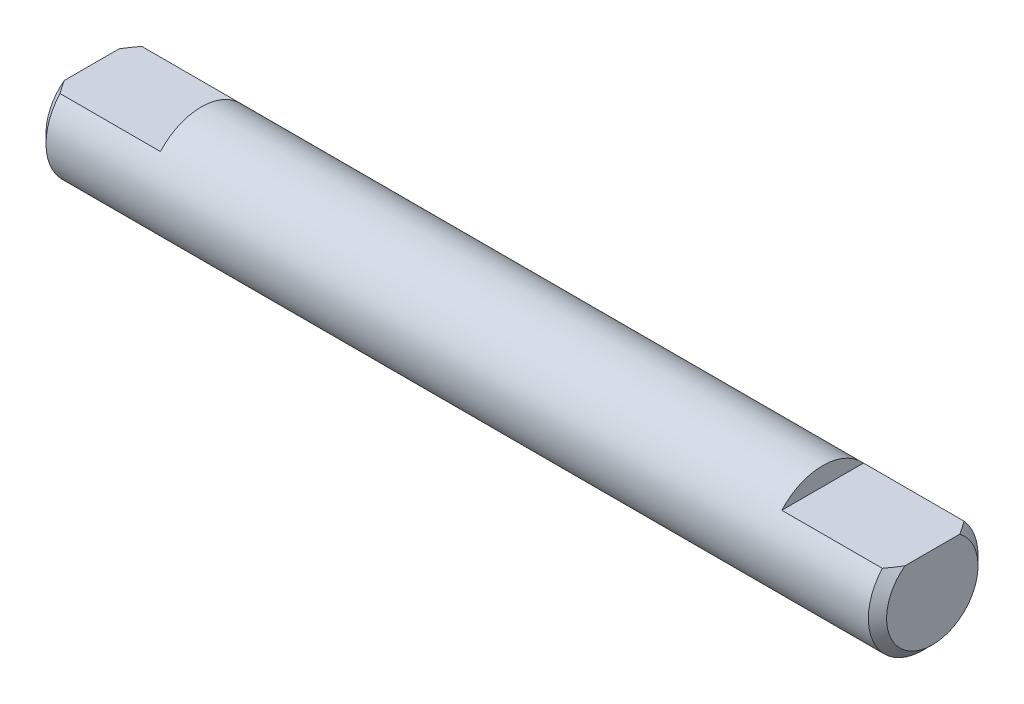
ISO-10303-21;
HEADER;
FILE_DESCRIPTION(('STEP AP214'),'2;1');
FILE_NAME('part.step','',(''),(''),'','','');
FILE_SCHEMA(('AUTOMOTIVE_DESIGN { 1 0 10303 214 1 1 1 1 }'));
ENDSEC;
DATA;
#1=APPLICATION_CONTEXT('core data for automotive mechanical design processes');
#2=APPLICATION_PROTOCOL_DEFINITION('international standard','automotive_design',2000,#1);
#3=PRODUCT_CONTEXT('',#1,'mechanical');
#4=PRODUCT('Part','Part','',(#3));
#5=PRODUCT_RELATED_PRODUCT_CATEGORY('part','',(#4));
#6=PRODUCT_DEFINITION_FORMATION('','',#4);
#7=PRODUCT_DEFINITION_CONTEXT('part definition',#1,'design');
#8=PRODUCT_DEFINITION('design','',#6,#7);
#9=PRODUCT_DEFINITION_SHAPE('','',#8);
#10=(LENGTH_UNIT() NAMED_UNIT(*) SI_UNIT(.MILLI.,.METRE.));
#11=(NAMED_UNIT(*) PLANE_ANGLE_UNIT() SI_UNIT($,.RADIAN.));
#12=(NAMED_UNIT(*) SI_UNIT($,.STERADIAN.) SOLID_ANGLE_UNIT());
#13=UNCERTAINTY_MEASURE_WITH_UNIT(LENGTH_MEASURE(1.E-05),#10,'distance_accuracy_value','');
#14=(GEOMETRIC_REPRESENTATION_CONTEXT(3) GLOBAL_UNCERTAINTY_ASSIGNED_CONTEXT((#13)) GLOBAL_UNIT_ASSIGNED_CONTEXT((#10,
#11,#12)) REPRESENTATION_CONTEXT('',''));
#15=CARTESIAN_POINT('',(0.,0.,0.));
#16=DIRECTION('',(0.,0.,1.));
#17=DIRECTION('',(1.,0.,0.));
#18=AXIS2_PLACEMENT_3D('',#15,#16,#17);
#19=CARTESIAN_POINT('',(23.,0.,0.));
#20=DIRECTION('',(-1.,0.,0.));
#21=DIRECTION('',(0.,0.,1.));
#22=AXIS2_PLACEMENT_3D('',#19,#20,#21);
#23=CYLINDRICAL_SURFACE('',#22,3.);
#24=CARTESIAN_POINT('',(22.5,0.,0.));
#25=DIRECTION('',(1.,0.,0.));
#26=DIRECTION('',(0.,0.,-1.));
#27=AXIS2_PLACEMENT_3D('',#24,#25,#26);
#28=CIRCLE('',#27,3.);
#29=CARTESIAN_POINT('',(22.5,2.,-2.23606797749979));
#30=VERTEX_POINT('',#29);
#31=CARTESIAN_POINT('',(22.5,2.,2.23606797749979));
#32=VERTEX_POINT('',#31);
#33=EDGE_CURVE('E135',#30,#32,#28,.F.);
#34=ORIENTED_EDGE('',*,*,#33,.T.);
#35=DIRECTION('',(1.,0.,0.));
#36=VECTOR('',#35,1.);
#37=CARTESIAN_POINT('',(17.,2.,2.23606797749979));
#38=LINE('',#37,#36);
#39=CARTESIAN_POINT('',(17.,2.,2.23606797749979));
#40=VERTEX_POINT('',#39);
#41=EDGE_CURVE('E128',#40,#32,#38,.T.);
#42=ORIENTED_EDGE('',*,*,#41,.F.);
#43=CARTESIAN_POINT('',(17.,0.,0.));
#44=DIRECTION('',(1.,0.,0.));
#45=DIRECTION('',(0.,0.,-1.));
#46=AXIS2_PLACEMENT_3D('',#43,#44,#45);
#47=CIRCLE('',#46,3.);
#48=CARTESIAN_POINT('',(17.,2.,-2.23606797749979));
#49=VERTEX_POINT('',#48);
#50=EDGE_CURVE('E121',#49,#40,#47,.T.);
#51=ORIENTED_EDGE('',*,*,#50,.F.);
#52=DIRECTION('',(1.,0.,0.));
#53=VECTOR('',#52,1.);
#54=CARTESIAN_POINT('',(17.,2.,-2.23606797749979));
#55=LINE('',#54,#53);
#56=EDGE_CURVE('E131',#49,#30,#55,.T.);
#57=ORIENTED_EDGE('',*,*,#56,.T.);
#58=EDGE_LOOP('',(#34,#42,#51,#57));
#59=FACE_BOUND('',#58,.T.);
#60=DIRECTION('',(-1.,0.,0.));
#61=VECTOR('',#60,1.);
#62=CARTESIAN_POINT('',(-17.,2.,-2.23606797749979));
#63=LINE('',#62,#61);
#64=CARTESIAN_POINT('',(-17.,2.,-2.23606797749979));
#65=VERTEX_POINT('',#64);
#66=CARTESIAN_POINT('',(-22.5,2.,-2.23606797749979));
#67=VERTEX_POINT('',#66);
#68=EDGE_CURVE('E61',#65,#67,#63,.T.);
#69=ORIENTED_EDGE('',*,*,#68,.F.);
#70=CARTESIAN_POINT('',(-17.,0.,0.));
#71=DIRECTION('',(1.,0.,0.));
#72=DIRECTION('',(0.,0.,-1.));
#73=AXIS2_PLACEMENT_3D('',#70,#71,#72);
#74=CIRCLE('',#73,3.);
#75=CARTESIAN_POINT('',(-17.,2.,2.23606797749979));
#76=VERTEX_POINT('',#75);
#77=EDGE_CURVE('E105',#65,#76,#74,.T.);
#78=ORIENTED_EDGE('',*,*,#77,.T.);
#79=DIRECTION('',(-1.,0.,0.));
#80=VECTOR('',#79,1.);
#81=CARTESIAN_POINT('',(-17.,2.,2.23606797749979));
#82=LINE('',#81,#80);
#83=CARTESIAN_POINT('',(-22.5,2.,2.23606797749979));
#84=VERTEX_POINT('',#83);
#85=EDGE_CURVE('E101',#76,#84,#82,.T.);
#86=ORIENTED_EDGE('',*,*,#85,.T.);
#87=CARTESIAN_POINT('',(-22.5,0.,0.));
#88=DIRECTION('',(1.,0.,0.));
#89=DIRECTION('',(0.,0.,-1.));
#90=AXIS2_PLACEMENT_3D('',#87,#88,#89);
#91=CIRCLE('',#90,3.);
#92=EDGE_CURVE('E114',#84,#67,#91,.T.);
#93=ORIENTED_EDGE('',*,*,#92,.T.);
#94=EDGE_LOOP('',(#69,#78,#86,#93));
#95=FACE_BOUND('',#94,.T.);
#96=ADVANCED_FACE('F39',(#59,#95),#23,.T.);
#97=CARTESIAN_POINT('',(-23.,0.,0.));
#98=DIRECTION('',(1.,0.,0.));
#99=DIRECTION('',(0.,0.,-1.));
#100=AXIS2_PLACEMENT_3D('',#97,#98,#99);
#101=PLANE('',#100);
#102=DIRECTION('',(0.,0.,-1.));
#103=VECTOR('',#102,1.);
#104=CARTESIAN_POINT('',(-23.,2.,2.23606797749979));
#105=LINE('',#104,#103);
#106=CARTESIAN_POINT('',(-23.,2.,1.49999999999999));
#107=VERTEX_POINT('',#106);
#108=CARTESIAN_POINT('',(-23.,2.,-1.49999999999999));
#109=VERTEX_POINT('',#108);
#110=EDGE_CURVE('E110',#107,#109,#105,.T.);
#111=ORIENTED_EDGE('',*,*,#110,.T.);
#112=CARTESIAN_POINT('',(-23.,0.,0.));
#113=DIRECTION('',(1.,0.,0.));
#114=DIRECTION('',(0.,0.,-1.));
#115=AXIS2_PLACEMENT_3D('',#112,#113,#114);
#116=CIRCLE('',#115,2.5);
#117=EDGE_CURVE('E143',#109,#107,#116,.F.);
#118=ORIENTED_EDGE('',*,*,#117,.T.);
#119=EDGE_LOOP('',(#111,#118));
#120=FACE_BOUND('',#119,.T.);
#121=ADVANCED_FACE('F169',(#120),#101,.F.);
#122=CARTESIAN_POINT('',(-22.5,0.,0.));
#123=DIRECTION('',(1.,0.,0.));
#124=DIRECTION('',(0.,0.,-1.));
#125=AXIS2_PLACEMENT_3D('',#122,#123,#124);
#126=CONICAL_SURFACE('',#125,3.,0.785398163397452);
#127=ORIENTED_EDGE('',*,*,#92,.F.);
#128=CARTESIAN_POINT('',(-20.1739562951765,2.,4.93626797749979));
#129=CARTESIAN_POINT('',(-20.3116263102323,2.,4.78768381124845));
#130=CARTESIAN_POINT('',(-20.4488688001703,2.,4.63869756596273));
#131=CARTESIAN_POINT('',(-20.7221404063521,2.,4.33955728207182));
#132=CARTESIAN_POINT('',(-20.8581692492664,2.,4.18940299398387));
#133=CARTESIAN_POINT('',(-21.1294043369861,2.,3.88672415849227));
#134=CARTESIAN_POINT('',(-21.2646007730296,2.,3.7341908006299));
#135=CARTESIAN_POINT('',(-21.5326839106298,2.,3.42713160304089));
#136=CARTESIAN_POINT('',(-21.6655708826726,2.,3.27260600039062));
#137=CARTESIAN_POINT('',(-21.9016416051834,2.,2.99210640438999));
#138=CARTESIAN_POINT('',(-22.0054251811024,2.,2.86663901089742));
#139=CARTESIAN_POINT('',(-22.2100672620052,2.,2.61328277643715));
#140=CARTESIAN_POINT('',(-22.3109250532625,2.,2.48539335700055));
#141=CARTESIAN_POINT('',(-22.5082990419047,2.,2.22650548443354));
#142=CARTESIAN_POINT('',(-22.6048202373963,2.,2.09551089088956));
#143=CARTESIAN_POINT('',(-22.7447671190917,2.,1.89566419584528));
#144=CARTESIAN_POINT('',(-22.7906025013962,2.,1.82850179908418));
#145=CARTESIAN_POINT('',(-22.8802458696183,2.,1.69284128038713));
#146=CARTESIAN_POINT('',(-22.9240540801268,2.,1.62434330762088));
#147=CARTESIAN_POINT('',(-23.0077568287426,2.,1.48797798387184));
#148=CARTESIAN_POINT('',(-23.0477316201661,2.,1.42016017631463));
#149=CARTESIAN_POINT('',(-23.124626643768,2.,1.28282423563598));
#150=CARTESIAN_POINT('',(-23.1615475696607,2.,1.21330649334523));
#151=CARTESIAN_POINT('',(-23.2314815211118,2.,1.07234023444369));
#152=CARTESIAN_POINT('',(-23.264496175163,2.,1.0008925377824));
#153=CARTESIAN_POINT('',(-23.3255401133741,2.,0.85592730514427));
#154=CARTESIAN_POINT('',(-23.3535707912893,2.,0.782410354510823));
#155=CARTESIAN_POINT('',(-23.4173281170312,2.,0.591196656014608));
#156=CARTESIAN_POINT('',(-23.44853668053,2.,0.471874440503044));
#157=CARTESIAN_POINT('',(-23.4798985537804,2.,0.290464949037767));
#158=CARTESIAN_POINT('',(-23.4877770901142,2.,0.229673626127377));
#159=CARTESIAN_POINT('',(-23.4980276880383,2.,0.107614500574353));
#160=CARTESIAN_POINT('',(-23.5004000751751,2.,0.0463467263164194));
#161=CARTESIAN_POINT('',(-23.4994876340507,2.,-0.0763197942470347));
#162=CARTESIAN_POINT('',(-23.4961865331302,2.,-0.137718411127131));
#163=CARTESIAN_POINT('',(-23.4840927327863,2.,-0.259968375583738));
#164=CARTESIAN_POINT('',(-23.4752996010043,2.,-0.320819679690591));
#165=CARTESIAN_POINT('',(-23.4526584972667,2.,-0.441758386957275));
#166=CARTESIAN_POINT('',(-23.4387947934545,2.,-0.501842803788246));
#167=CARTESIAN_POINT('',(-23.4066497947718,2.,-0.620801694696722));
#168=CARTESIAN_POINT('',(-23.3883682885415,2.,-0.679676110738205));
#169=CARTESIAN_POINT('',(-23.32353373849,2.,-0.867010178133715));
#170=CARTESIAN_POINT('',(-23.269655609127,2.,-0.992934833748156));
#171=CARTESIAN_POINT('',(-23.1498194583963,2.,-1.23892735531403));
#172=CARTESIAN_POINT('',(-23.0838370471123,2.,-1.35898276485906));
#173=CARTESIAN_POINT('',(-22.9431293700758,2.,-1.59585458502193));
#174=CARTESIAN_POINT('',(-22.8683039830242,2.,-1.71261073718885));
#175=CARTESIAN_POINT('',(-22.7133369591881,2.,-1.94233316376557));
#176=CARTESIAN_POINT('',(-22.6332002257383,2.,-2.05530279263013));
#177=CARTESIAN_POINT('',(-22.4584536139599,2.,-2.29310526083196));
#178=CARTESIAN_POINT('',(-22.3633231135208,2.,-2.4175531463146));
#179=CARTESIAN_POINT('',(-22.169770359034,2.,-2.66387185446492));
#180=CARTESIAN_POINT('',(-22.0713476398,2.,-2.78574230894003));
#181=CARTESIAN_POINT('',(-21.8720580954331,2.,-3.02764935246809));
#182=CARTESIAN_POINT('',(-21.7711891086712,2.,-3.14768415452678));
#183=CARTESIAN_POINT('',(-21.5677067244689,2.,-3.38626695152413));
#184=CARTESIAN_POINT('',(-21.4650932831408,2.,-3.50481490892545));
#185=CARTESIAN_POINT('',(-21.2645083359917,2.,-3.73393503767578));
#186=CARTESIAN_POINT('',(-21.1666110971079,2.,-3.84457235346526));
#187=CARTESIAN_POINT('',(-20.9698872405432,2.,-4.0650206650625));
#188=CARTESIAN_POINT('',(-20.8710606043089,2.,-4.17483164429524));
#189=CARTESIAN_POINT('',(-20.672861613006,2.,-4.39356418106756));
#190=CARTESIAN_POINT('',(-20.5734907230783,2.,-4.50248706778862));
#191=CARTESIAN_POINT('',(-20.3741449318645,2.,-4.71977019005837));
#192=CARTESIAN_POINT('',(-20.2741700570922,2.,-4.82813044992246));
#193=CARTESIAN_POINT('',(-20.1739562951765,2.,-4.93626797749979));
#194=B_SPLINE_CURVE_WITH_KNOTS('',3,(#128,#129,#130,#131,#132,#133,#134,#135,#136,#137,#138,
#139,#140,#141,#142,#143,#144,#145,#146,#147,#148,#149,#150,#151,#152,#153,#154,#155,#156,#157,
#158,#159,#160,#161,#162,#163,#164,#165,#166,#167,#168,#169,#170,#171,#172,#173,#174,#175,#176,
#177,#178,#179,#180,#181,#182,#183,#184,#185,#186,#187,#188,#189,#190,#191,#192,#193),
.UNSPECIFIED.,.F.,.F.,(4,2,2,2,2,2,2,2,2,2,2,2,2,2,2,2,2,2,2,2,2,2,2,2,2,2,2,2,2,2,2,2,4),(0.,
0.607683822515699,1.21550121371796,1.82695959733875,2.43834587720767,2.92679827952436,
3.41536885142092,3.90336106917609,4.14727001406463,4.39115187121073,4.62725676477006,
4.86330787673309,5.09926023157596,5.33514649886008,5.70350071953635,5.88718743593394,
6.07086329173091,6.25506684494243,6.4392849013503,6.62407942586769,6.80888279321206,
7.21864694206687,7.62924601323273,8.04504397302749,8.46046328332827,8.93031101628628,
9.40022542091196,9.87057139026386,10.3409292103109,10.7841162696073,11.2273121949651,
11.6696319276303,12.1119323824531),.UNSPECIFIED.);
#195=EDGE_CURVE('E11',#84,#107,#194,.T.);
#196=ORIENTED_EDGE('',*,*,#195,.T.);
#197=ORIENTED_EDGE('',*,*,#117,.F.);
#198=EDGE_CURVE('E44',#109,#67,#194,.T.);
#199=ORIENTED_EDGE('',*,*,#198,.T.);
#200=EDGE_LOOP('',(#127,#196,#197,#199));
#201=FACE_BOUND('',#200,.T.);
#202=ADVANCED_FACE('F167',(#201),#126,.T.);
#203=CARTESIAN_POINT('',(23.,0.,0.));
#204=DIRECTION('',(1.,0.,0.));
#205=DIRECTION('',(0.,0.,-1.));
#206=AXIS2_PLACEMENT_3D('',#203,#204,#205);
#207=PLANE('',#206);
#208=DIRECTION('',(0.,0.,-1.));
#209=VECTOR('',#208,1.);
#210=CARTESIAN_POINT('',(23.,2.,2.23606797749979));
#211=LINE('',#210,#209);
#212=CARTESIAN_POINT('',(23.,2.,1.5));
#213=VERTEX_POINT('',#212);
#214=CARTESIAN_POINT('',(23.,2.,-1.5));
#215=VERTEX_POINT('',#214);
#216=EDGE_CURVE('E69',#213,#215,#211,.T.);
#217=ORIENTED_EDGE('',*,*,#216,.F.);
#218=CARTESIAN_POINT('',(23.,0.,0.));
#219=DIRECTION('',(1.,0.,0.));
#220=DIRECTION('',(0.,0.,-1.));
#221=AXIS2_PLACEMENT_3D('',#218,#219,#220);
#222=CIRCLE('',#221,2.5);
#223=EDGE_CURVE('E147',#213,#215,#222,.T.);
#224=ORIENTED_EDGE('',*,*,#223,.T.);
#225=EDGE_LOOP('',(#217,#224));
#226=FACE_BOUND('',#225,.T.);
#227=ADVANCED_FACE('F164',(#226),#207,.T.);
#228=CARTESIAN_POINT('',(23.,0.,0.));
#229=DIRECTION('',(-1.,0.,0.));
#230=DIRECTION('',(0.,0.,1.));
#231=AXIS2_PLACEMENT_3D('',#228,#229,#230);
#232=CONICAL_SURFACE('',#231,2.5,0.785398163397445);
#233=CARTESIAN_POINT('',(20.1739562951765,2.,4.93626797749979));
#234=CARTESIAN_POINT('',(20.3116263102323,2.,4.78768381124845));
#235=CARTESIAN_POINT('',(20.4488688001702,2.,4.63869756596274));
#236=CARTESIAN_POINT('',(20.7221404063521,2.,4.33955728207182));
#237=CARTESIAN_POINT('',(20.8581692492664,2.,4.18940299398388));
#238=CARTESIAN_POINT('',(21.1294043369861,2.,3.88672415849228));
#239=CARTESIAN_POINT('',(21.2646007730296,2.,3.73419080062991));
#240=CARTESIAN_POINT('',(21.5326839106297,2.,3.4271316030409));
#241=CARTESIAN_POINT('',(21.6655708826726,2.,3.27260600039064));
#242=CARTESIAN_POINT('',(21.9016416051834,2.,2.99210640439001));
#243=CARTESIAN_POINT('',(22.0054251811024,2.,2.86663901089745));
#244=CARTESIAN_POINT('',(22.2100672620051,2.,2.61328277643719));
#245=CARTESIAN_POINT('',(22.3109250532624,2.,2.48539335700059));
#246=CARTESIAN_POINT('',(22.5082990419047,2.,2.22650548443359));
#247=CARTESIAN_POINT('',(22.6048202373962,2.,2.09551089088962));
#248=CARTESIAN_POINT('',(22.7447671190917,2.,1.89566419584535));
#249=CARTESIAN_POINT('',(22.7906025013961,2.,1.82850179908424));
#250=CARTESIAN_POINT('',(22.8802458696183,2.,1.6928412803872));
#251=CARTESIAN_POINT('',(22.9240540801268,2.,1.62434330762096));
#252=CARTESIAN_POINT('',(23.0077568287426,2.,1.48797798387191));
#253=CARTESIAN_POINT('',(23.0477316201661,2.,1.42016017631471));
#254=CARTESIAN_POINT('',(23.1246266437679,2.,1.28282423563605));
#255=CARTESIAN_POINT('',(23.1615475696606,2.,1.2133064933453));
#256=CARTESIAN_POINT('',(23.2314815211118,2.,1.07234023444376));
#257=CARTESIAN_POINT('',(23.2644961751629,2.,1.00089253778247));
#258=CARTESIAN_POINT('',(23.3255401133741,2.,0.855927305144334));
#259=CARTESIAN_POINT('',(23.3535707912893,2.,0.782410354510885));
#260=CARTESIAN_POINT('',(23.4173281170312,2.,0.591196656014668));
#261=CARTESIAN_POINT('',(23.44853668053,2.,0.471874440503104));
#262=CARTESIAN_POINT('',(23.4798985537804,2.,0.290464949037828));
#263=CARTESIAN_POINT('',(23.4877770901142,2.,0.229673626127439));
#264=CARTESIAN_POINT('',(23.4980276880384,2.,0.107614500574415));
#265=CARTESIAN_POINT('',(23.5004000751751,2.,0.046346726316481));
#266=CARTESIAN_POINT('',(23.4994876340507,2.,-0.0763197942469739));
#267=CARTESIAN_POINT('',(23.4961865331302,2.,-0.13771841112707));
#268=CARTESIAN_POINT('',(23.4840927327863,2.,-0.259968375583678));
#269=CARTESIAN_POINT('',(23.4752996010044,2.,-0.320819679690532));
#270=CARTESIAN_POINT('',(23.4526584972667,2.,-0.441758386957216));
#271=CARTESIAN_POINT('',(23.4387947934545,2.,-0.501842803788188));
#272=CARTESIAN_POINT('',(23.4066497947718,2.,-0.620801694696665));
#273=CARTESIAN_POINT('',(23.3883682885415,2.,-0.679676110738149));
#274=CARTESIAN_POINT('',(23.32353373849,2.,-0.867010178133648));
#275=CARTESIAN_POINT('',(23.2696556091271,2.,-0.992934833748078));
#276=CARTESIAN_POINT('',(23.1498194583964,2.,-1.23892735531393));
#277=CARTESIAN_POINT('',(23.0838370471123,2.,-1.35898276485895));
#278=CARTESIAN_POINT('',(22.9431293700759,2.,-1.5958545850218));
#279=CARTESIAN_POINT('',(22.8683039830243,2.,-1.71261073718871));
#280=CARTESIAN_POINT('',(22.7133369591882,2.,-1.94233316376541));
#281=CARTESIAN_POINT('',(22.6332002257384,2.,-2.05530279262996));
#282=CARTESIAN_POINT('',(22.45845361396,2.,-2.2931052608318));
#283=CARTESIAN_POINT('',(22.363323113521,2.,-2.41755314631445));
#284=CARTESIAN_POINT('',(22.1697703590341,2.,-2.66387185446479));
#285=CARTESIAN_POINT('',(22.0713476398001,2.,-2.78574230893991));
#286=CARTESIAN_POINT('',(21.8720580954332,2.,-3.02764935246798));
#287=CARTESIAN_POINT('',(21.7711891086713,2.,-3.14768415452668));
#288=CARTESIAN_POINT('',(21.5677067244689,2.,-3.38626695152405));
#289=CARTESIAN_POINT('',(21.4650932831408,2.,-3.50481490892537));
#290=CARTESIAN_POINT('',(21.2645083359917,2.,-3.73393503767572));
#291=CARTESIAN_POINT('',(21.1666110971079,2.,-3.84457235346521));
#292=CARTESIAN_POINT('',(20.9698872405432,2.,-4.06502066506245));
#293=CARTESIAN_POINT('',(20.8710606043089,2.,-4.1748316442952));
#294=CARTESIAN_POINT('',(20.672861613006,2.,-4.39356418106754));
#295=CARTESIAN_POINT('',(20.5734907230783,2.,-4.5024870677886));
#296=CARTESIAN_POINT('',(20.3741449318645,2.,-4.71977019005836));
#297=CARTESIAN_POINT('',(20.2741700570922,2.,-4.82813044992245));
#298=CARTESIAN_POINT('',(20.1739562951765,2.,-4.93626797749979));
#299=B_SPLINE_CURVE_WITH_KNOTS('',3,(#233,#234,#235,#236,#237,#238,#239,#240,#241,#242,#243,
#244,#245,#246,#247,#248,#249,#250,#251,#252,#253,#254,#255,#256,#257,#258,#259,#260,#261,#262,
#263,#264,#265,#266,#267,#268,#269,#270,#271,#272,#273,#274,#275,#276,#277,#278,#279,#280,#281,
#282,#283,#284,#285,#286,#287,#288,#289,#290,#291,#292,#293,#294,#295,#296,#297,#298),
.UNSPECIFIED.,.F.,.F.,(4,2,2,2,2,2,2,2,2,2,2,2,2,2,2,2,2,2,2,2,2,2,2,2,2,2,2,2,2,2,2,2,4),(0.,
0.607683822515695,1.21550121371795,1.82695959733874,2.43834587720766,2.92679827952434,
3.41536885142089,3.90336106917604,4.14727001406458,4.39115187121067,4.62725676477,
4.86330787673303,5.09926023157592,5.33514649886005,5.70350071953631,5.88718743593391,
6.07086329173088,6.2550668449424,6.43928490135027,6.62407942586766,6.80888279321203,
7.2186469420668,7.62924601323263,8.04504397302735,8.46046328332809,8.93031101628614,
9.40022542091185,9.87057139026379,10.3409292103109,10.7841162696073,11.2273121949651,
11.6696319276303,12.1119323824532),.UNSPECIFIED.);
#300=EDGE_CURVE('E157',#32,#213,#299,.T.);
#301=ORIENTED_EDGE('',*,*,#300,.F.);
#302=ORIENTED_EDGE('',*,*,#33,.F.);
#303=EDGE_CURVE('E150',#215,#30,#299,.T.);
#304=ORIENTED_EDGE('',*,*,#303,.F.);
#305=ORIENTED_EDGE('',*,*,#223,.F.);
#306=EDGE_LOOP('',(#301,#302,#304,#305));
#307=FACE_BOUND('',#306,.T.);
#308=ADVANCED_FACE('F41',(#307),#232,.T.);
#309=CARTESIAN_POINT('',(17.,2.,2.23606797749979));
#310=DIRECTION('',(0.,-1.,0.));
#311=DIRECTION('',(0.,0.,-1.));
#312=AXIS2_PLACEMENT_3D('',#309,#310,#311);
#313=PLANE('',#312);
#314=ORIENTED_EDGE('',*,*,#300,.T.);
#315=ORIENTED_EDGE('',*,*,#216,.T.);
#316=ORIENTED_EDGE('',*,*,#303,.T.);
#317=ORIENTED_EDGE('',*,*,#56,.F.);
#318=DIRECTION('',(0.,0.,-1.));
#319=VECTOR('',#318,1.);
#320=CARTESIAN_POINT('',(17.,2.,2.23606797749979));
#321=LINE('',#320,#319);
#322=EDGE_CURVE('E124',#40,#49,#321,.T.);
#323=ORIENTED_EDGE('',*,*,#322,.F.);
#324=ORIENTED_EDGE('',*,*,#41,.T.);
#325=EDGE_LOOP('',(#314,#315,#316,#317,#323,#324));
#326=FACE_BOUND('',#325,.T.);
#327=ADVANCED_FACE('F158',(#326),#313,.F.);
#328=CARTESIAN_POINT('',(17.,0.,0.));
#329=DIRECTION('',(1.,0.,0.));
#330=DIRECTION('',(0.,0.,-1.));
#331=AXIS2_PLACEMENT_3D('',#328,#329,#330);
#332=PLANE('',#331);
#333=ORIENTED_EDGE('',*,*,#50,.T.);
#334=ORIENTED_EDGE('',*,*,#322,.T.);
#335=EDGE_LOOP('',(#333,#334));
#336=FACE_BOUND('',#335,.T.);
#337=ADVANCED_FACE('F163',(#336),#332,.T.);
#338=CARTESIAN_POINT('',(-17.,2.,2.23606797749979));
#339=DIRECTION('',(0.,1.,0.));
#340=DIRECTION('',(0.,0.,1.));
#341=AXIS2_PLACEMENT_3D('',#338,#339,#340);
#342=PLANE('',#341);
#343=ORIENTED_EDGE('',*,*,#85,.F.);
#344=DIRECTION('',(0.,0.,-1.));
#345=VECTOR('',#344,1.);
#346=CARTESIAN_POINT('',(-17.,2.,2.23606797749979));
#347=LINE('',#346,#345);
#348=EDGE_CURVE('E97',#76,#65,#347,.T.);
#349=ORIENTED_EDGE('',*,*,#348,.T.);
#350=ORIENTED_EDGE('',*,*,#68,.T.);
#351=ORIENTED_EDGE('',*,*,#198,.F.);
#352=ORIENTED_EDGE('',*,*,#110,.F.);
#353=ORIENTED_EDGE('',*,*,#195,.F.);
#354=EDGE_LOOP('',(#343,#349,#350,#351,#352,#353));
#355=FACE_BOUND('',#354,.T.);
#356=ADVANCED_FACE('F99',(#355),#342,.T.);
#357=CARTESIAN_POINT('',(-17.,0.,0.));
#358=DIRECTION('',(-1.,0.,0.));
#359=DIRECTION('',(0.,0.,-1.));
#360=AXIS2_PLACEMENT_3D('',#357,#358,#359);
#361=PLANE('',#360);
#362=ORIENTED_EDGE('',*,*,#77,.F.);
#363=ORIENTED_EDGE('',*,*,#348,.F.);
#364=EDGE_LOOP('',(#362,#363));
#365=FACE_BOUND('',#364,.T.);
#366=ADVANCED_FACE('F107',(#365),#361,.T.);
#367=CLOSED_SHELL('',(#96,#121,#202,#227,#308,#327,#337,#356,#366));
#368=MANIFOLD_SOLID_BREP('B2',#367);
#369=ADVANCED_BREP_SHAPE_REPRESENTATION('',(#18,#368),#14);
#370=SHAPE_DEFINITION_REPRESENTATION(#9,#369);
ENDSEC;
END-ISO-10303-21;
